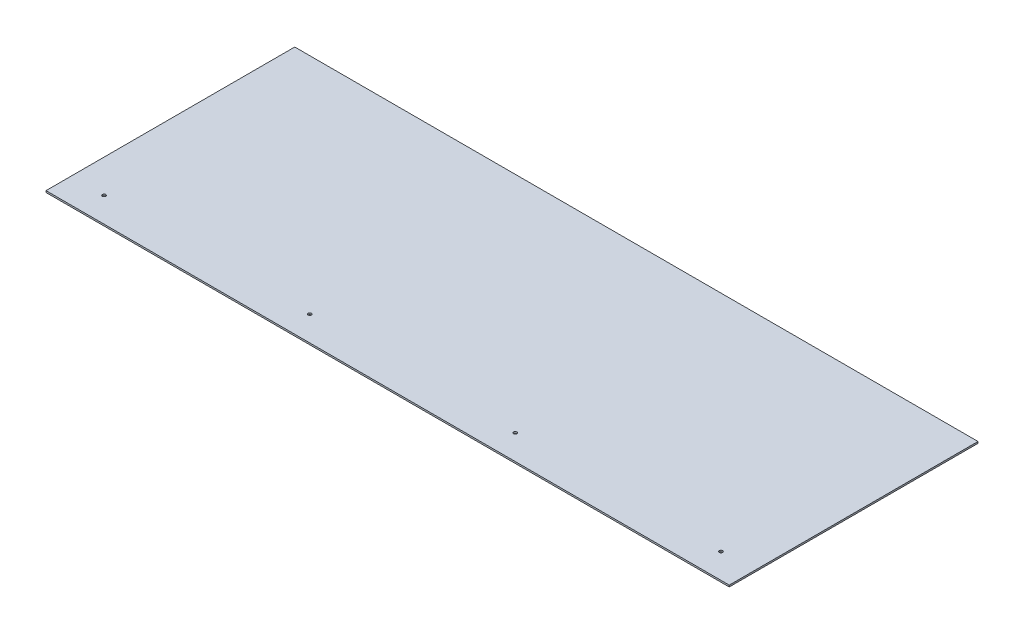
ISO-10303-21;
HEADER;
FILE_DESCRIPTION(('STEP AP214'),'2;1');
FILE_NAME('part.step','',(''),(''),'','','');
FILE_SCHEMA(('AUTOMOTIVE_DESIGN { 1 0 10303 214 1 1 1 1 }'));
ENDSEC;
DATA;
#1=APPLICATION_CONTEXT('core data for automotive mechanical design processes');
#2=APPLICATION_PROTOCOL_DEFINITION('international standard','automotive_design',2000,#1);
#3=PRODUCT_CONTEXT('',#1,'mechanical');
#4=PRODUCT('Part','Part','',(#3));
#5=PRODUCT_RELATED_PRODUCT_CATEGORY('part','',(#4));
#6=PRODUCT_DEFINITION_FORMATION('','',#4);
#7=PRODUCT_DEFINITION_CONTEXT('part definition',#1,'design');
#8=PRODUCT_DEFINITION('design','',#6,#7);
#9=PRODUCT_DEFINITION_SHAPE('','',#8);
#10=(LENGTH_UNIT() NAMED_UNIT(*) SI_UNIT(.MILLI.,.METRE.));
#11=(NAMED_UNIT(*) PLANE_ANGLE_UNIT() SI_UNIT($,.RADIAN.));
#12=(NAMED_UNIT(*) SI_UNIT($,.STERADIAN.) SOLID_ANGLE_UNIT());
#13=UNCERTAINTY_MEASURE_WITH_UNIT(LENGTH_MEASURE(1.E-05),#10,'distance_accuracy_value','');
#14=(GEOMETRIC_REPRESENTATION_CONTEXT(3) GLOBAL_UNCERTAINTY_ASSIGNED_CONTEXT((#13)) GLOBAL_UNIT_ASSIGNED_CONTEXT((#10,
#11,#12)) REPRESENTATION_CONTEXT('',''));
#15=CARTESIAN_POINT('',(0.,0.,0.));
#16=DIRECTION('',(0.,0.,1.));
#17=DIRECTION('',(1.,0.,0.));
#18=AXIS2_PLACEMENT_3D('',#15,#16,#17);
#19=CARTESIAN_POINT('',(3797.3,-3.175,238.125));
#20=DIRECTION('',(0.,-1.,0.));
#21=DIRECTION('',(0.,0.,-1.));
#22=AXIS2_PLACEMENT_3D('',#19,#20,#21);
#23=PLANE('',#22);
#24=DIRECTION('',(0.,0.,1.));
#25=VECTOR('',#24,1.);
#26=CARTESIAN_POINT('',(4451.35,-3.175,238.125));
#27=LINE('',#26,#25);
#28=CARTESIAN_POINT('',(4451.35,-3.175,0.));
#29=VERTEX_POINT('',#28);
#30=CARTESIAN_POINT('',(4451.35,-3.175,476.25));
#31=VERTEX_POINT('',#30);
#32=EDGE_CURVE('E58',#29,#31,#27,.T.);
#33=ORIENTED_EDGE('',*,*,#32,.T.);
#34=DIRECTION('',(1.,0.,0.));
#35=VECTOR('',#34,1.);
#36=CARTESIAN_POINT('',(3797.3,-3.175,476.25));
#37=LINE('',#36,#35);
#38=CARTESIAN_POINT('',(3143.25,-3.175,476.25));
#39=VERTEX_POINT('',#38);
#40=EDGE_CURVE('E50',#39,#31,#37,.T.);
#41=ORIENTED_EDGE('',*,*,#40,.F.);
#42=DIRECTION('',(0.,0.,1.));
#43=VECTOR('',#42,1.);
#44=CARTESIAN_POINT('',(3143.25,-3.175,238.125));
#45=LINE('',#44,#43);
#46=CARTESIAN_POINT('',(3143.25,-3.175,0.));
#47=VERTEX_POINT('',#46);
#48=EDGE_CURVE('E60',#47,#39,#45,.T.);
#49=ORIENTED_EDGE('',*,*,#48,.F.);
#50=DIRECTION('',(1.,0.,0.));
#51=VECTOR('',#50,1.);
#52=CARTESIAN_POINT('',(3797.3,-3.175,0.));
#53=LINE('',#52,#51);
#54=EDGE_CURVE('E55',#47,#29,#53,.T.);
#55=ORIENTED_EDGE('',*,*,#54,.T.);
#56=EDGE_LOOP('',(#33,#41,#49,#55));
#57=FACE_BOUND('',#56,.T.);
#58=CARTESIAN_POINT('',(3206.75,-3.17499999999971,428.625));
#59=DIRECTION('',(0.,-1.,0.));
#60=DIRECTION('',(0.,0.,-1.));
#61=AXIS2_PLACEMENT_3D('',#58,#59,#60);
#62=CIRCLE('',#61,3.175);
#63=CARTESIAN_POINT('',(3206.75,-3.17499999999971,425.45));
#64=VERTEX_POINT('',#63);
#65=EDGE_CURVE('E66',#64,#64,#62,.F.);
#66=ORIENTED_EDGE('',*,*,#65,.T.);
#67=EDGE_LOOP('',(#66));
#68=FACE_BOUND('',#67,.T.);
#69=CARTESIAN_POINT('',(3600.45,-3.17499999999971,428.625));
#70=DIRECTION('',(0.,-1.,0.));
#71=DIRECTION('',(0.,0.,-1.));
#72=AXIS2_PLACEMENT_3D('',#69,#70,#71);
#73=CIRCLE('',#72,3.175);
#74=CARTESIAN_POINT('',(3600.45,-3.17499999999971,425.45));
#75=VERTEX_POINT('',#74);
#76=EDGE_CURVE('E94',#75,#75,#73,.F.);
#77=ORIENTED_EDGE('',*,*,#76,.T.);
#78=EDGE_LOOP('',(#77));
#79=FACE_BOUND('',#78,.T.);
#80=CARTESIAN_POINT('',(3994.15,-3.17499999999971,428.625));
#81=DIRECTION('',(0.,-1.,0.));
#82=DIRECTION('',(0.,0.,-1.));
#83=AXIS2_PLACEMENT_3D('',#80,#81,#82);
#84=CIRCLE('',#83,3.175);
#85=CARTESIAN_POINT('',(3994.15,-3.17499999999971,425.45));
#86=VERTEX_POINT('',#85);
#87=EDGE_CURVE('E96',#86,#86,#84,.F.);
#88=ORIENTED_EDGE('',*,*,#87,.T.);
#89=EDGE_LOOP('',(#88));
#90=FACE_BOUND('',#89,.T.);
#91=CARTESIAN_POINT('',(4387.85,-3.17499999999971,428.625));
#92=DIRECTION('',(0.,-1.,0.));
#93=DIRECTION('',(0.,0.,-1.));
#94=AXIS2_PLACEMENT_3D('',#91,#92,#93);
#95=CIRCLE('',#94,3.175);
#96=CARTESIAN_POINT('',(4387.85,-3.17499999999971,425.45));
#97=VERTEX_POINT('',#96);
#98=EDGE_CURVE('E17',#97,#97,#95,.F.);
#99=ORIENTED_EDGE('',*,*,#98,.T.);
#100=EDGE_LOOP('',(#99));
#101=FACE_BOUND('',#100,.T.);
#102=ADVANCED_FACE('F14',(#57,#68,#79,#90,#101),#23,.T.);
#103=CARTESIAN_POINT('',(4387.85,-7227.09274295138,428.625));
#104=DIRECTION('',(0.,-1.,0.));
#105=DIRECTION('',(0.,0.,-1.));
#106=AXIS2_PLACEMENT_3D('',#103,#104,#105);
#107=CYLINDRICAL_SURFACE('',#106,3.175);
#108=CARTESIAN_POINT('',(4387.85,0.,428.625));
#109=DIRECTION('',(0.,-1.,0.));
#110=DIRECTION('',(0.,0.,-1.));
#111=AXIS2_PLACEMENT_3D('',#108,#109,#110);
#112=CIRCLE('',#111,3.175);
#113=CARTESIAN_POINT('',(4387.85,0.,425.45));
#114=VERTEX_POINT('',#113);
#115=EDGE_CURVE('E89',#114,#114,#112,.F.);
#116=ORIENTED_EDGE('',*,*,#115,.T.);
#117=EDGE_LOOP('',(#116));
#118=FACE_BOUND('',#117,.T.);
#119=ORIENTED_EDGE('',*,*,#98,.F.);
#120=EDGE_LOOP('',(#119));
#121=FACE_BOUND('',#120,.T.);
#122=ADVANCED_FACE('F104',(#118,#121),#107,.F.);
#123=CARTESIAN_POINT('',(3994.15,-7227.09274295138,428.625));
#124=DIRECTION('',(0.,-1.,0.));
#125=DIRECTION('',(0.,0.,-1.));
#126=AXIS2_PLACEMENT_3D('',#123,#124,#125);
#127=CYLINDRICAL_SURFACE('',#126,3.175);
#128=CARTESIAN_POINT('',(3994.15,0.,428.625));
#129=DIRECTION('',(0.,-1.,0.));
#130=DIRECTION('',(0.,0.,-1.));
#131=AXIS2_PLACEMENT_3D('',#128,#129,#130);
#132=CIRCLE('',#131,3.175);
#133=CARTESIAN_POINT('',(3994.15,0.,425.45));
#134=VERTEX_POINT('',#133);
#135=EDGE_CURVE('E86',#134,#134,#132,.F.);
#136=ORIENTED_EDGE('',*,*,#135,.T.);
#137=EDGE_LOOP('',(#136));
#138=FACE_BOUND('',#137,.T.);
#139=ORIENTED_EDGE('',*,*,#87,.F.);
#140=EDGE_LOOP('',(#139));
#141=FACE_BOUND('',#140,.T.);
#142=ADVANCED_FACE('F106',(#138,#141),#127,.F.);
#143=CARTESIAN_POINT('',(3600.45,-7227.09274295138,428.625));
#144=DIRECTION('',(0.,-1.,0.));
#145=DIRECTION('',(0.,0.,-1.));
#146=AXIS2_PLACEMENT_3D('',#143,#144,#145);
#147=CYLINDRICAL_SURFACE('',#146,3.175);
#148=CARTESIAN_POINT('',(3600.45,0.,428.625));
#149=DIRECTION('',(0.,-1.,0.));
#150=DIRECTION('',(0.,0.,-1.));
#151=AXIS2_PLACEMENT_3D('',#148,#149,#150);
#152=CIRCLE('',#151,3.175);
#153=CARTESIAN_POINT('',(3600.45,0.,425.45));
#154=VERTEX_POINT('',#153);
#155=EDGE_CURVE('E83',#154,#154,#152,.F.);
#156=ORIENTED_EDGE('',*,*,#155,.T.);
#157=EDGE_LOOP('',(#156));
#158=FACE_BOUND('',#157,.T.);
#159=ORIENTED_EDGE('',*,*,#76,.F.);
#160=EDGE_LOOP('',(#159));
#161=FACE_BOUND('',#160,.T.);
#162=ADVANCED_FACE('F113',(#158,#161),#147,.F.);
#163=CARTESIAN_POINT('',(3206.75,-7227.09274295138,428.625));
#164=DIRECTION('',(0.,-1.,0.));
#165=DIRECTION('',(0.,0.,-1.));
#166=AXIS2_PLACEMENT_3D('',#163,#164,#165);
#167=CYLINDRICAL_SURFACE('',#166,3.175);
#168=CARTESIAN_POINT('',(3206.75,0.,428.625));
#169=DIRECTION('',(0.,-1.,0.));
#170=DIRECTION('',(0.,0.,-1.));
#171=AXIS2_PLACEMENT_3D('',#168,#169,#170);
#172=CIRCLE('',#171,3.175);
#173=CARTESIAN_POINT('',(3206.75,0.,425.45));
#174=VERTEX_POINT('',#173);
#175=EDGE_CURVE('E80',#174,#174,#172,.F.);
#176=ORIENTED_EDGE('',*,*,#175,.T.);
#177=EDGE_LOOP('',(#176));
#178=FACE_BOUND('',#177,.T.);
#179=ORIENTED_EDGE('',*,*,#65,.F.);
#180=EDGE_LOOP('',(#179));
#181=FACE_BOUND('',#180,.T.);
#182=ADVANCED_FACE('F135',(#178,#181),#167,.F.);
#183=CARTESIAN_POINT('',(3797.3,-3.175,0.));
#184=DIRECTION('',(0.,0.,1.));
#185=DIRECTION('',(1.,0.,0.));
#186=AXIS2_PLACEMENT_3D('',#183,#184,#185);
#187=PLANE('',#186);
#188=DIRECTION('',(0.,1.,0.));
#189=VECTOR('',#188,1.);
#190=CARTESIAN_POINT('',(4451.35,-3.175,0.));
#191=LINE('',#190,#189);
#192=CARTESIAN_POINT('',(4451.35,0.,0.));
#193=VERTEX_POINT('',#192);
#194=EDGE_CURVE('E65',#193,#29,#191,.F.);
#195=ORIENTED_EDGE('',*,*,#194,.T.);
#196=ORIENTED_EDGE('',*,*,#54,.F.);
#197=DIRECTION('',(0.,1.,0.));
#198=VECTOR('',#197,1.);
#199=CARTESIAN_POINT('',(3143.25,-3.175,0.));
#200=LINE('',#199,#198);
#201=CARTESIAN_POINT('',(3143.25,0.,0.));
#202=VERTEX_POINT('',#201);
#203=EDGE_CURVE('E225',#202,#47,#200,.F.);
#204=ORIENTED_EDGE('',*,*,#203,.F.);
#205=DIRECTION('',(1.,0.,0.));
#206=VECTOR('',#205,1.);
#207=CARTESIAN_POINT('',(3797.3,0.,0.));
#208=LINE('',#207,#206);
#209=EDGE_CURVE('E76',#202,#193,#208,.T.);
#210=ORIENTED_EDGE('',*,*,#209,.T.);
#211=EDGE_LOOP('',(#195,#196,#204,#210));
#212=FACE_BOUND('',#211,.T.);
#213=ADVANCED_FACE('F75',(#212),#187,.F.);
#214=CARTESIAN_POINT('',(4451.35,-3.175,238.125));
#215=DIRECTION('',(-1.,0.,0.));
#216=DIRECTION('',(0.,0.,1.));
#217=AXIS2_PLACEMENT_3D('',#214,#215,#216);
#218=PLANE('',#217);
#219=DIRECTION('',(0.,1.,0.));
#220=VECTOR('',#219,1.);
#221=CARTESIAN_POINT('',(4451.35,-3.175,476.25));
#222=LINE('',#221,#220);
#223=CARTESIAN_POINT('',(4451.35,0.,476.25));
#224=VERTEX_POINT('',#223);
#225=EDGE_CURVE('E72',#31,#224,#222,.T.);
#226=ORIENTED_EDGE('',*,*,#225,.F.);
#227=ORIENTED_EDGE('',*,*,#32,.F.);
#228=ORIENTED_EDGE('',*,*,#194,.F.);
#229=DIRECTION('',(0.,0.,-1.));
#230=VECTOR('',#229,1.);
#231=CARTESIAN_POINT('',(4451.35,0.,238.125));
#232=LINE('',#231,#230);
#233=EDGE_CURVE('E218',#193,#224,#232,.F.);
#234=ORIENTED_EDGE('',*,*,#233,.T.);
#235=EDGE_LOOP('',(#226,#227,#228,#234));
#236=FACE_BOUND('',#235,.T.);
#237=ADVANCED_FACE('F69',(#236),#218,.F.);
#238=CARTESIAN_POINT('',(3797.3,-3.175,476.25));
#239=DIRECTION('',(0.,0.,1.));
#240=DIRECTION('',(1.,0.,0.));
#241=AXIS2_PLACEMENT_3D('',#238,#239,#240);
#242=PLANE('',#241);
#243=ORIENTED_EDGE('',*,*,#40,.T.);
#244=ORIENTED_EDGE('',*,*,#225,.T.);
#245=DIRECTION('',(1.,0.,0.));
#246=VECTOR('',#245,1.);
#247=CARTESIAN_POINT('',(3797.3,0.,476.25));
#248=LINE('',#247,#246);
#249=CARTESIAN_POINT('',(3143.25,0.,476.25));
#250=VERTEX_POINT('',#249);
#251=EDGE_CURVE('E23',#224,#250,#248,.F.);
#252=ORIENTED_EDGE('',*,*,#251,.T.);
#253=DIRECTION('',(0.,1.,0.));
#254=VECTOR('',#253,1.);
#255=CARTESIAN_POINT('',(3143.25,-3.175,476.25));
#256=LINE('',#255,#254);
#257=EDGE_CURVE('E31',#39,#250,#256,.T.);
#258=ORIENTED_EDGE('',*,*,#257,.F.);
#259=EDGE_LOOP('',(#243,#244,#252,#258));
#260=FACE_BOUND('',#259,.T.);
#261=ADVANCED_FACE('F124',(#260),#242,.T.);
#262=CARTESIAN_POINT('',(3143.25,-3.175,238.125));
#263=DIRECTION('',(-1.,0.,0.));
#264=DIRECTION('',(0.,0.,1.));
#265=AXIS2_PLACEMENT_3D('',#262,#263,#264);
#266=PLANE('',#265);
#267=ORIENTED_EDGE('',*,*,#48,.T.);
#268=ORIENTED_EDGE('',*,*,#257,.T.);
#269=DIRECTION('',(0.,0.,-1.));
#270=VECTOR('',#269,1.);
#271=CARTESIAN_POINT('',(3143.25,0.,238.125));
#272=LINE('',#271,#270);
#273=EDGE_CURVE('E9',#250,#202,#272,.T.);
#274=ORIENTED_EDGE('',*,*,#273,.T.);
#275=ORIENTED_EDGE('',*,*,#203,.T.);
#276=EDGE_LOOP('',(#267,#268,#274,#275));
#277=FACE_BOUND('',#276,.T.);
#278=ADVANCED_FACE('F118',(#277),#266,.T.);
#279=CARTESIAN_POINT('',(3797.3,0.,238.125));
#280=DIRECTION('',(0.,-1.,0.));
#281=DIRECTION('',(0.,0.,-1.));
#282=AXIS2_PLACEMENT_3D('',#279,#280,#281);
#283=PLANE('',#282);
#284=ORIENTED_EDGE('',*,*,#251,.F.);
#285=ORIENTED_EDGE('',*,*,#233,.F.);
#286=ORIENTED_EDGE('',*,*,#209,.F.);
#287=ORIENTED_EDGE('',*,*,#273,.F.);
#288=EDGE_LOOP('',(#284,#285,#286,#287));
#289=FACE_BOUND('',#288,.T.);
#290=ORIENTED_EDGE('',*,*,#175,.F.);
#291=EDGE_LOOP('',(#290));
#292=FACE_BOUND('',#291,.T.);
#293=ORIENTED_EDGE('',*,*,#155,.F.);
#294=EDGE_LOOP('',(#293));
#295=FACE_BOUND('',#294,.T.);
#296=ORIENTED_EDGE('',*,*,#135,.F.);
#297=EDGE_LOOP('',(#296));
#298=FACE_BOUND('',#297,.T.);
#299=ORIENTED_EDGE('',*,*,#115,.F.);
#300=EDGE_LOOP('',(#299));
#301=FACE_BOUND('',#300,.T.);
#302=ADVANCED_FACE('F116',(#289,#292,#295,#298,#301),#283,.F.);
#303=CLOSED_SHELL('',(#102,#122,#142,#162,#182,#213,#237,#261,#278,#302));
#304=MANIFOLD_SOLID_BREP('B1',#303);
#305=ADVANCED_BREP_SHAPE_REPRESENTATION('',(#18,#304),#14);
#306=SHAPE_DEFINITION_REPRESENTATION(#9,#305);
ENDSEC;
END-ISO-10303-21;
